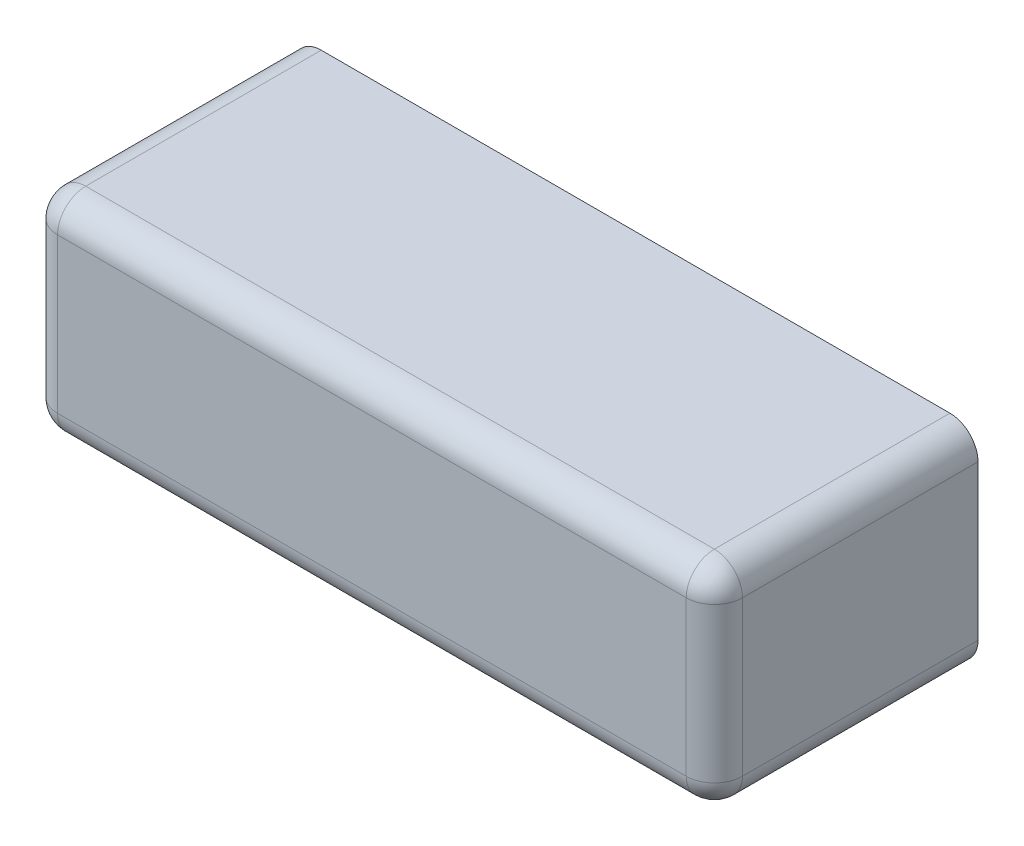
ISO-10303-21;
HEADER;
FILE_DESCRIPTION(('STEP AP214'),'2;1');
FILE_NAME('part.step','',(''),(''),'','','');
FILE_SCHEMA(('AUTOMOTIVE_DESIGN { 1 0 10303 214 1 1 1 1 }'));
ENDSEC;
DATA;
#1=APPLICATION_CONTEXT('core data for automotive mechanical design processes');
#2=APPLICATION_PROTOCOL_DEFINITION('international standard','automotive_design',2000,#1);
#3=PRODUCT_CONTEXT('',#1,'mechanical');
#4=PRODUCT('Part','Part','',(#3));
#5=PRODUCT_RELATED_PRODUCT_CATEGORY('part','',(#4));
#6=PRODUCT_DEFINITION_FORMATION('','',#4);
#7=PRODUCT_DEFINITION_CONTEXT('part definition',#1,'design');
#8=PRODUCT_DEFINITION('design','',#6,#7);
#9=PRODUCT_DEFINITION_SHAPE('','',#8);
#10=(LENGTH_UNIT() NAMED_UNIT(*) SI_UNIT(.MILLI.,.METRE.));
#11=(NAMED_UNIT(*) PLANE_ANGLE_UNIT() SI_UNIT($,.RADIAN.));
#12=(NAMED_UNIT(*) SI_UNIT($,.STERADIAN.) SOLID_ANGLE_UNIT());
#13=UNCERTAINTY_MEASURE_WITH_UNIT(LENGTH_MEASURE(1.E-05),#10,'distance_accuracy_value','');
#14=(GEOMETRIC_REPRESENTATION_CONTEXT(3) GLOBAL_UNCERTAINTY_ASSIGNED_CONTEXT((#13)) GLOBAL_UNIT_ASSIGNED_CONTEXT((#10,
#11,#12)) REPRESENTATION_CONTEXT('',''));
#15=CARTESIAN_POINT('',(0.,0.,0.));
#16=DIRECTION('',(0.,0.,1.));
#17=DIRECTION('',(1.,0.,0.));
#18=AXIS2_PLACEMENT_3D('',#15,#16,#17);
#19=CARTESIAN_POINT('',(-149.675063922113,-3.08847499691146,202.274504892547));
#20=DIRECTION('',(-1.,0.,0.));
#21=DIRECTION('',(0.,-1.,0.));
#22=AXIS2_PLACEMENT_3D('',#19,#20,#21);
#23=SPHERICAL_SURFACE('',#22,0.8);
#24=CARTESIAN_POINT('',(-149.675063922113,-3.08847499691146,202.274504892547));
#25=DIRECTION('',(0.,-1.,0.));
#26=DIRECTION('',(0.,0.,-1.));
#27=AXIS2_PLACEMENT_3D('',#24,#25,#26);
#28=CIRCLE('',#27,0.8);
#29=CARTESIAN_POINT('',(-150.475063922113,-3.08847499691146,202.274504892547));
#30=VERTEX_POINT('',#29);
#31=CARTESIAN_POINT('',(-149.675063922113,-3.08847499691146,203.074504892547));
#32=VERTEX_POINT('',#31);
#33=EDGE_CURVE('E221',#30,#32,#28,.F.);
#34=ORIENTED_EDGE('',*,*,#33,.F.);
#35=CARTESIAN_POINT('',(-149.675063922113,-3.08847499691146,202.274504892547));
#36=DIRECTION('',(0.,0.,-1.));
#37=DIRECTION('',(-1.,0.,0.));
#38=AXIS2_PLACEMENT_3D('',#35,#36,#37);
#39=CIRCLE('',#38,0.8);
#40=CARTESIAN_POINT('',(-149.675063922113,-3.88847499691146,202.274504892547));
#41=VERTEX_POINT('',#40);
#42=EDGE_CURVE('E71',#41,#30,#39,.T.);
#43=ORIENTED_EDGE('',*,*,#42,.F.);
#44=CARTESIAN_POINT('',(-149.675063922113,-3.08847499691146,202.274504892547));
#45=DIRECTION('',(1.,0.,0.));
#46=DIRECTION('',(0.,0.,-1.));
#47=AXIS2_PLACEMENT_3D('',#44,#45,#46);
#48=CIRCLE('',#47,0.8);
#49=EDGE_CURVE('E72',#32,#41,#48,.T.);
#50=ORIENTED_EDGE('',*,*,#49,.F.);
#51=EDGE_LOOP('',(#34,#43,#50));
#52=FACE_BOUND('',#51,.T.);
#53=ADVANCED_FACE('F17',(#52),#23,.T.);
#54=CARTESIAN_POINT('',(-131.775063922113,-3.08847499691146,202.274504892547));
#55=DIRECTION('',(-1.,0.,0.));
#56=DIRECTION('',(0.,-1.,0.));
#57=AXIS2_PLACEMENT_3D('',#54,#55,#56);
#58=SPHERICAL_SURFACE('',#57,0.8);
#59=CARTESIAN_POINT('',(-131.775063922113,-3.08847499691146,202.274504892547));
#60=DIRECTION('',(1.,0.,0.));
#61=DIRECTION('',(0.,0.,-1.));
#62=AXIS2_PLACEMENT_3D('',#59,#60,#61);
#63=CIRCLE('',#62,0.8);
#64=CARTESIAN_POINT('',(-131.775063922113,-3.88847499691146,202.274504892547));
#65=VERTEX_POINT('',#64);
#66=CARTESIAN_POINT('',(-131.775063922113,-3.08847499691146,203.074504892547));
#67=VERTEX_POINT('',#66);
#68=EDGE_CURVE('E216',#65,#67,#63,.F.);
#69=ORIENTED_EDGE('',*,*,#68,.F.);
#70=CARTESIAN_POINT('',(-131.775063922113,-3.08847499691146,202.274504892547));
#71=DIRECTION('',(0.,0.,-1.));
#72=DIRECTION('',(-1.,0.,0.));
#73=AXIS2_PLACEMENT_3D('',#70,#71,#72);
#74=CIRCLE('',#73,0.8);
#75=CARTESIAN_POINT('',(-130.975063922113,-3.08847499691146,202.274504892547));
#76=VERTEX_POINT('',#75);
#77=EDGE_CURVE('E191',#76,#65,#74,.T.);
#78=ORIENTED_EDGE('',*,*,#77,.F.);
#79=CARTESIAN_POINT('',(-131.775063922113,-3.08847499691146,202.274504892547));
#80=DIRECTION('',(0.,1.,0.));
#81=DIRECTION('',(0.,0.,1.));
#82=AXIS2_PLACEMENT_3D('',#79,#80,#81);
#83=CIRCLE('',#82,0.8);
#84=EDGE_CURVE('E198',#67,#76,#83,.T.);
#85=ORIENTED_EDGE('',*,*,#84,.F.);
#86=EDGE_LOOP('',(#69,#78,#85));
#87=FACE_BOUND('',#86,.T.);
#88=ADVANCED_FACE('F235',(#87),#58,.T.);
#89=CARTESIAN_POINT('',(-149.675063922113,-3.88847499691146,202.274504892547));
#90=DIRECTION('',(0.,-1.,0.));
#91=DIRECTION('',(0.,0.,-1.));
#92=AXIS2_PLACEMENT_3D('',#89,#90,#91);
#93=CYLINDRICAL_SURFACE('',#92,0.8);
#94=ORIENTED_EDGE('',*,*,#33,.T.);
#95=DIRECTION('',(0.,1.,0.));
#96=VECTOR('',#95,1.);
#97=CARTESIAN_POINT('',(-149.675063922113,-3.88847499691146,203.074504892547));
#98=LINE('',#97,#96);
#99=CARTESIAN_POINT('',(-149.675063922113,1.31152500308761,203.074504892547));
#100=VERTEX_POINT('',#99);
#101=EDGE_CURVE('E179',#100,#32,#98,.F.);
#102=ORIENTED_EDGE('',*,*,#101,.F.);
#103=CARTESIAN_POINT('',(-149.675063922113,1.31152500308854,202.274504892547));
#104=DIRECTION('',(0.,1.,3.06649722635464E-12));
#105=DIRECTION('',(-1.,0.,0.));
#106=AXIS2_PLACEMENT_3D('',#103,#104,#105);
#107=CIRCLE('',#106,0.8);
#108=CARTESIAN_POINT('',(-150.475063922113,1.31152500308853,202.274504892547));
#109=VERTEX_POINT('',#108);
#110=EDGE_CURVE('E168',#109,#100,#107,.T.);
#111=ORIENTED_EDGE('',*,*,#110,.F.);
#112=DIRECTION('',(0.,1.,0.));
#113=VECTOR('',#112,1.);
#114=CARTESIAN_POINT('',(-150.475063922113,-3.88847499691146,202.274504892547));
#115=LINE('',#114,#113);
#116=EDGE_CURVE('E171',#109,#30,#115,.F.);
#117=ORIENTED_EDGE('',*,*,#116,.T.);
#118=EDGE_LOOP('',(#94,#102,#111,#117));
#119=FACE_BOUND('',#118,.T.);
#120=ADVANCED_FACE('F238',(#119),#93,.T.);
#121=CARTESIAN_POINT('',(-130.975063922113,-3.08847499691146,202.274504892547));
#122=DIRECTION('',(1.,0.,0.));
#123=DIRECTION('',(0.,0.,-1.));
#124=AXIS2_PLACEMENT_3D('',#121,#122,#123);
#125=CYLINDRICAL_SURFACE('',#124,0.8);
#126=ORIENTED_EDGE('',*,*,#49,.T.);
#127=DIRECTION('',(1.,0.,0.));
#128=VECTOR('',#127,1.);
#129=CARTESIAN_POINT('',(-130.975063922113,-3.88847499691146,202.274504892547));
#130=LINE('',#129,#128);
#131=EDGE_CURVE('E80',#41,#65,#130,.T.);
#132=ORIENTED_EDGE('',*,*,#131,.T.);
#133=ORIENTED_EDGE('',*,*,#68,.T.);
#134=DIRECTION('',(1.,0.,0.));
#135=VECTOR('',#134,1.);
#136=CARTESIAN_POINT('',(-130.975063922113,-3.08847499691146,203.074504892547));
#137=LINE('',#136,#135);
#138=EDGE_CURVE('E172',#32,#67,#137,.T.);
#139=ORIENTED_EDGE('',*,*,#138,.F.);
#140=EDGE_LOOP('',(#126,#132,#133,#139));
#141=FACE_BOUND('',#140,.T.);
#142=ADVANCED_FACE('F242',(#141),#125,.T.);
#143=CARTESIAN_POINT('',(-149.675063922113,-3.08847499691146,203.074504892547));
#144=DIRECTION('',(0.,0.,-1.));
#145=DIRECTION('',(-1.,0.,0.));
#146=AXIS2_PLACEMENT_3D('',#143,#144,#145);
#147=CYLINDRICAL_SURFACE('',#146,0.8);
#148=DIRECTION('',(0.,0.,1.));
#149=VECTOR('',#148,1.);
#150=CARTESIAN_POINT('',(-149.675063922113,-3.88847499691146,203.074504892547));
#151=LINE('',#150,#149);
#152=CARTESIAN_POINT('',(-149.675063922113,-3.88847499691146,195.567624300072));
#153=VERTEX_POINT('',#152);
#154=EDGE_CURVE('E67',#153,#41,#151,.T.);
#155=ORIENTED_EDGE('',*,*,#154,.T.);
#156=ORIENTED_EDGE('',*,*,#42,.T.);
#157=DIRECTION('',(0.,0.,-1.));
#158=VECTOR('',#157,1.);
#159=CARTESIAN_POINT('',(-150.475063922113,-3.08847499691146,203.074504892547));
#160=LINE('',#159,#158);
#161=CARTESIAN_POINT('',(-150.475063922113,-3.08847499691146,195.567624300072));
#162=VERTEX_POINT('',#161);
#163=EDGE_CURVE('E69',#30,#162,#160,.T.);
#164=ORIENTED_EDGE('',*,*,#163,.T.);
#165=CARTESIAN_POINT('',(-149.675063922113,-3.08847499691146,195.567624300072));
#166=DIRECTION('',(0.,0.,-1.));
#167=DIRECTION('',(-1.,0.,0.));
#168=AXIS2_PLACEMENT_3D('',#165,#166,#167);
#169=CIRCLE('',#168,0.8);
#170=EDGE_CURVE('E21',#162,#153,#169,.F.);
#171=ORIENTED_EDGE('',*,*,#170,.T.);
#172=EDGE_LOOP('',(#155,#156,#164,#171));
#173=FACE_BOUND('',#172,.T.);
#174=ADVANCED_FACE('F64',(#173),#147,.T.);
#175=CARTESIAN_POINT('',(-131.775063922113,-3.88847499691146,202.274504892547));
#176=DIRECTION('',(0.,1.,0.));
#177=DIRECTION('',(0.,0.,1.));
#178=AXIS2_PLACEMENT_3D('',#175,#176,#177);
#179=CYLINDRICAL_SURFACE('',#178,0.8);
#180=ORIENTED_EDGE('',*,*,#84,.T.);
#181=DIRECTION('',(0.,1.,0.));
#182=VECTOR('',#181,1.);
#183=CARTESIAN_POINT('',(-130.975063922113,2.11152500308854,202.274504892547));
#184=LINE('',#183,#182);
#185=CARTESIAN_POINT('',(-130.975063922113,1.31152500308853,202.274504892547));
#186=VERTEX_POINT('',#185);
#187=EDGE_CURVE('E82',#76,#186,#184,.T.);
#188=ORIENTED_EDGE('',*,*,#187,.T.);
#189=CARTESIAN_POINT('',(-131.775063922113,1.31152500308853,202.274504892547));
#190=DIRECTION('',(0.,1.,0.));
#191=DIRECTION('',(0.,0.,1.));
#192=AXIS2_PLACEMENT_3D('',#189,#190,#191);
#193=CIRCLE('',#192,0.8);
#194=CARTESIAN_POINT('',(-131.775063922113,1.31152500308853,203.074504892547));
#195=VERTEX_POINT('',#194);
#196=EDGE_CURVE('E201',#186,#195,#193,.F.);
#197=ORIENTED_EDGE('',*,*,#196,.T.);
#198=DIRECTION('',(0.,1.,0.));
#199=VECTOR('',#198,1.);
#200=CARTESIAN_POINT('',(-131.775063922113,-3.88847499691146,203.074504892547));
#201=LINE('',#200,#199);
#202=EDGE_CURVE('E182',#67,#195,#201,.T.);
#203=ORIENTED_EDGE('',*,*,#202,.F.);
#204=EDGE_LOOP('',(#180,#188,#197,#203));
#205=FACE_BOUND('',#204,.T.);
#206=ADVANCED_FACE('F249',(#205),#179,.T.);
#207=CARTESIAN_POINT('',(-131.775063922113,-3.08847499691146,203.074504892547));
#208=DIRECTION('',(0.,0.,-1.));
#209=DIRECTION('',(-1.,0.,0.));
#210=AXIS2_PLACEMENT_3D('',#207,#208,#209);
#211=CYLINDRICAL_SURFACE('',#210,0.8);
#212=DIRECTION('',(0.,0.,1.));
#213=VECTOR('',#212,1.);
#214=CARTESIAN_POINT('',(-130.975063922113,-3.08847499691146,203.074504892547));
#215=LINE('',#214,#213);
#216=CARTESIAN_POINT('',(-130.975063922113,-3.08847499691146,195.567624300072));
#217=VERTEX_POINT('',#216);
#218=EDGE_CURVE('E128',#217,#76,#215,.T.);
#219=ORIENTED_EDGE('',*,*,#218,.T.);
#220=ORIENTED_EDGE('',*,*,#77,.T.);
#221=DIRECTION('',(0.,0.,1.));
#222=VECTOR('',#221,1.);
#223=CARTESIAN_POINT('',(-131.775063922113,-3.88847499691146,203.074504892547));
#224=LINE('',#223,#222);
#225=CARTESIAN_POINT('',(-131.775063922113,-3.88847499691146,195.567624300072));
#226=VERTEX_POINT('',#225);
#227=EDGE_CURVE('E83',#65,#226,#224,.F.);
#228=ORIENTED_EDGE('',*,*,#227,.T.);
#229=CARTESIAN_POINT('',(-131.775063922113,-3.08847499691146,195.567624300072));
#230=DIRECTION('',(0.,0.,-1.));
#231=DIRECTION('',(-1.,0.,0.));
#232=AXIS2_PLACEMENT_3D('',#229,#230,#231);
#233=CIRCLE('',#232,0.8);
#234=EDGE_CURVE('E87',#226,#217,#233,.F.);
#235=ORIENTED_EDGE('',*,*,#234,.T.);
#236=EDGE_LOOP('',(#219,#220,#228,#235));
#237=FACE_BOUND('',#236,.T.);
#238=ADVANCED_FACE('F251',(#237),#211,.T.);
#239=CARTESIAN_POINT('',(-130.975063922113,-3.88847499691146,203.074504892547));
#240=DIRECTION('',(0.,0.,1.));
#241=DIRECTION('',(1.,0.,0.));
#242=AXIS2_PLACEMENT_3D('',#239,#240,#241);
#243=PLANE('',#242);
#244=ORIENTED_EDGE('',*,*,#101,.T.);
#245=ORIENTED_EDGE('',*,*,#138,.T.);
#246=ORIENTED_EDGE('',*,*,#202,.T.);
#247=DIRECTION('',(-1.,0.,0.));
#248=VECTOR('',#247,1.);
#249=CARTESIAN_POINT('',(-130.975063922113,1.31152500308853,203.074504892547));
#250=LINE('',#249,#248);
#251=EDGE_CURVE('E122',#100,#195,#250,.F.);
#252=ORIENTED_EDGE('',*,*,#251,.F.);
#253=EDGE_LOOP('',(#244,#245,#246,#252));
#254=FACE_BOUND('',#253,.T.);
#255=ADVANCED_FACE('F160',(#254),#243,.T.);
#256=CARTESIAN_POINT('',(-149.675063922113,1.31152500308853,202.274504892547));
#257=DIRECTION('',(-1.,0.,0.));
#258=DIRECTION('',(0.,-1.,0.));
#259=AXIS2_PLACEMENT_3D('',#256,#257,#258);
#260=SPHERICAL_SURFACE('',#259,0.8);
#261=ORIENTED_EDGE('',*,*,#110,.T.);
#262=CARTESIAN_POINT('',(-149.675063922113,1.31152500308853,202.274504892547));
#263=DIRECTION('',(-1.,0.,0.));
#264=DIRECTION('',(0.,0.,1.));
#265=AXIS2_PLACEMENT_3D('',#262,#263,#264);
#266=CIRCLE('',#265,0.8);
#267=CARTESIAN_POINT('',(-149.675063922113,2.11152500308854,202.274504892547));
#268=VERTEX_POINT('',#267);
#269=EDGE_CURVE('E119',#268,#100,#266,.F.);
#270=ORIENTED_EDGE('',*,*,#269,.F.);
#271=CARTESIAN_POINT('',(-149.675063922113,1.31152500308853,202.274504892547));
#272=DIRECTION('',(0.,0.,-1.));
#273=DIRECTION('',(-1.,0.,0.));
#274=AXIS2_PLACEMENT_3D('',#271,#272,#273);
#275=CIRCLE('',#274,0.8);
#276=EDGE_CURVE('E108',#109,#268,#275,.T.);
#277=ORIENTED_EDGE('',*,*,#276,.F.);
#278=EDGE_LOOP('',(#261,#270,#277));
#279=FACE_BOUND('',#278,.T.);
#280=ADVANCED_FACE('F155',(#279),#260,.T.);
#281=CARTESIAN_POINT('',(-150.475063922113,-3.88847499691146,203.074504892547));
#282=DIRECTION('',(1.,0.,0.));
#283=DIRECTION('',(0.,0.,-1.));
#284=AXIS2_PLACEMENT_3D('',#281,#282,#283);
#285=PLANE('',#284);
#286=DIRECTION('',(0.,1.,0.));
#287=VECTOR('',#286,1.);
#288=CARTESIAN_POINT('',(-150.475063922113,-3.88847499691146,195.567624300072));
#289=LINE('',#288,#287);
#290=CARTESIAN_POINT('',(-150.475063922113,1.31152500308853,195.567624300072));
#291=VERTEX_POINT('',#290);
#292=EDGE_CURVE('E90',#291,#162,#289,.F.);
#293=ORIENTED_EDGE('',*,*,#292,.T.);
#294=ORIENTED_EDGE('',*,*,#163,.F.);
#295=ORIENTED_EDGE('',*,*,#116,.F.);
#296=DIRECTION('',(0.,0.,-1.));
#297=VECTOR('',#296,1.);
#298=CARTESIAN_POINT('',(-150.475063922113,1.31152500308853,203.074504892547));
#299=LINE('',#298,#297);
#300=EDGE_CURVE('E111',#291,#109,#299,.F.);
#301=ORIENTED_EDGE('',*,*,#300,.F.);
#302=EDGE_LOOP('',(#293,#294,#295,#301));
#303=FACE_BOUND('',#302,.T.);
#304=ADVANCED_FACE('F152',(#303),#285,.F.);
#305=CARTESIAN_POINT('',(-130.975063922113,-3.88847499691146,203.074504892547));
#306=DIRECTION('',(0.,1.,0.));
#307=DIRECTION('',(0.,0.,1.));
#308=AXIS2_PLACEMENT_3D('',#305,#306,#307);
#309=PLANE('',#308);
#310=DIRECTION('',(1.,0.,0.));
#311=VECTOR('',#310,1.);
#312=CARTESIAN_POINT('',(-130.975063922113,-3.88847499691146,195.567624300072));
#313=LINE('',#312,#311);
#314=EDGE_CURVE('E78',#153,#226,#313,.T.);
#315=ORIENTED_EDGE('',*,*,#314,.T.);
#316=ORIENTED_EDGE('',*,*,#227,.F.);
#317=ORIENTED_EDGE('',*,*,#131,.F.);
#318=ORIENTED_EDGE('',*,*,#154,.F.);
#319=EDGE_LOOP('',(#315,#316,#317,#318));
#320=FACE_BOUND('',#319,.T.);
#321=ADVANCED_FACE('F76',(#320),#309,.F.);
#322=CARTESIAN_POINT('',(-130.975063922113,2.11152500308854,203.074504892547));
#323=DIRECTION('',(-1.,0.,0.));
#324=DIRECTION('',(0.,0.,1.));
#325=AXIS2_PLACEMENT_3D('',#322,#323,#324);
#326=PLANE('',#325);
#327=DIRECTION('',(0.,1.,0.));
#328=VECTOR('',#327,1.);
#329=CARTESIAN_POINT('',(-130.975063922113,-3.88847499691146,195.567624300072));
#330=LINE('',#329,#328);
#331=CARTESIAN_POINT('',(-130.975063922113,1.31152500308853,195.567624300072));
#332=VERTEX_POINT('',#331);
#333=EDGE_CURVE('E89',#217,#332,#330,.T.);
#334=ORIENTED_EDGE('',*,*,#333,.T.);
#335=DIRECTION('',(0.,0.,-1.));
#336=VECTOR('',#335,1.);
#337=CARTESIAN_POINT('',(-130.975063922113,1.31152500308853,203.074504892547));
#338=LINE('',#337,#336);
#339=EDGE_CURVE('E93',#186,#332,#338,.T.);
#340=ORIENTED_EDGE('',*,*,#339,.F.);
#341=ORIENTED_EDGE('',*,*,#187,.F.);
#342=ORIENTED_EDGE('',*,*,#218,.F.);
#343=EDGE_LOOP('',(#334,#340,#341,#342));
#344=FACE_BOUND('',#343,.T.);
#345=ADVANCED_FACE('F144',(#344),#326,.F.);
#346=CARTESIAN_POINT('',(-131.775063922113,1.31152500308853,202.274504892547));
#347=DIRECTION('',(-1.,0.,0.));
#348=DIRECTION('',(0.,-1.,0.));
#349=AXIS2_PLACEMENT_3D('',#346,#347,#348);
#350=SPHERICAL_SURFACE('',#349,0.8);
#351=ORIENTED_EDGE('',*,*,#196,.F.);
#352=CARTESIAN_POINT('',(-131.775063922113,1.31152500308853,202.274504892547));
#353=DIRECTION('',(0.,0.,-1.));
#354=DIRECTION('',(-1.,0.,0.));
#355=AXIS2_PLACEMENT_3D('',#352,#353,#354);
#356=CIRCLE('',#355,0.8);
#357=CARTESIAN_POINT('',(-131.775063922113,2.11152500308854,202.274504892547));
#358=VERTEX_POINT('',#357);
#359=EDGE_CURVE('E116',#358,#186,#356,.T.);
#360=ORIENTED_EDGE('',*,*,#359,.F.);
#361=CARTESIAN_POINT('',(-131.775063922113,1.31152500308853,202.274504892547));
#362=DIRECTION('',(-1.,0.,0.));
#363=DIRECTION('',(0.,0.,1.));
#364=AXIS2_PLACEMENT_3D('',#361,#362,#363);
#365=CIRCLE('',#364,0.8);
#366=EDGE_CURVE('E123',#195,#358,#365,.T.);
#367=ORIENTED_EDGE('',*,*,#366,.F.);
#368=EDGE_LOOP('',(#351,#360,#367));
#369=FACE_BOUND('',#368,.T.);
#370=ADVANCED_FACE('F139',(#369),#350,.T.);
#371=CARTESIAN_POINT('',(-130.975063922113,1.31152500308853,202.274504892547));
#372=DIRECTION('',(-1.,0.,0.));
#373=DIRECTION('',(0.,0.,1.));
#374=AXIS2_PLACEMENT_3D('',#371,#372,#373);
#375=CYLINDRICAL_SURFACE('',#374,0.8);
#376=ORIENTED_EDGE('',*,*,#269,.T.);
#377=ORIENTED_EDGE('',*,*,#251,.T.);
#378=ORIENTED_EDGE('',*,*,#366,.T.);
#379=DIRECTION('',(1.,0.,0.));
#380=VECTOR('',#379,1.);
#381=CARTESIAN_POINT('',(-150.475063922113,2.11152500308854,202.274504892547));
#382=LINE('',#381,#380);
#383=EDGE_CURVE('E101',#358,#268,#382,.F.);
#384=ORIENTED_EDGE('',*,*,#383,.T.);
#385=EDGE_LOOP('',(#376,#377,#378,#384));
#386=FACE_BOUND('',#385,.T.);
#387=ADVANCED_FACE('F143',(#386),#375,.T.);
#388=CARTESIAN_POINT('',(-149.675063922113,1.31152500308853,203.074504892547));
#389=DIRECTION('',(0.,0.,-1.));
#390=DIRECTION('',(-1.,0.,0.));
#391=AXIS2_PLACEMENT_3D('',#388,#389,#390);
#392=CYLINDRICAL_SURFACE('',#391,0.8);
#393=ORIENTED_EDGE('',*,*,#300,.T.);
#394=ORIENTED_EDGE('',*,*,#276,.T.);
#395=DIRECTION('',(0.,0.,-1.));
#396=VECTOR('',#395,1.);
#397=CARTESIAN_POINT('',(-149.675063922113,2.11152500308854,203.074504892547));
#398=LINE('',#397,#396);
#399=CARTESIAN_POINT('',(-149.675063922113,2.11152500308854,195.567624300072));
#400=VERTEX_POINT('',#399);
#401=EDGE_CURVE('E98',#268,#400,#398,.T.);
#402=ORIENTED_EDGE('',*,*,#401,.T.);
#403=CARTESIAN_POINT('',(-149.675063922113,1.31152500308853,195.567624300072));
#404=DIRECTION('',(0.,0.,-1.));
#405=DIRECTION('',(-1.,0.,0.));
#406=AXIS2_PLACEMENT_3D('',#403,#404,#405);
#407=CIRCLE('',#406,0.8);
#408=EDGE_CURVE('E95',#400,#291,#407,.F.);
#409=ORIENTED_EDGE('',*,*,#408,.T.);
#410=EDGE_LOOP('',(#393,#394,#402,#409));
#411=FACE_BOUND('',#410,.T.);
#412=ADVANCED_FACE('F273',(#411),#392,.T.);
#413=CARTESIAN_POINT('',(-130.975063922113,-3.88847499691146,195.567624300072));
#414=DIRECTION('',(0.,0.,1.));
#415=DIRECTION('',(1.,0.,0.));
#416=AXIS2_PLACEMENT_3D('',#413,#414,#415);
#417=PLANE('',#416);
#418=CARTESIAN_POINT('',(-131.775063922113,1.31152500308853,195.567624300072));
#419=DIRECTION('',(0.,0.,-1.));
#420=DIRECTION('',(-1.,0.,0.));
#421=AXIS2_PLACEMENT_3D('',#418,#419,#420);
#422=CIRCLE('',#421,0.8);
#423=CARTESIAN_POINT('',(-131.775063922113,2.11152500308854,195.567624300072));
#424=VERTEX_POINT('',#423);
#425=EDGE_CURVE('E35',#332,#424,#422,.F.);
#426=ORIENTED_EDGE('',*,*,#425,.F.);
#427=ORIENTED_EDGE('',*,*,#333,.F.);
#428=ORIENTED_EDGE('',*,*,#234,.F.);
#429=ORIENTED_EDGE('',*,*,#314,.F.);
#430=ORIENTED_EDGE('',*,*,#170,.F.);
#431=ORIENTED_EDGE('',*,*,#292,.F.);
#432=ORIENTED_EDGE('',*,*,#408,.F.);
#433=DIRECTION('',(1.,0.,0.));
#434=VECTOR('',#433,1.);
#435=CARTESIAN_POINT('',(-150.475063922113,2.11152500308854,195.567624300072));
#436=LINE('',#435,#434);
#437=EDGE_CURVE('E27',#400,#424,#436,.T.);
#438=ORIENTED_EDGE('',*,*,#437,.T.);
#439=EDGE_LOOP('',(#426,#427,#428,#429,#430,#431,#432,#438));
#440=FACE_BOUND('',#439,.T.);
#441=ADVANCED_FACE('F85',(#440),#417,.F.);
#442=CARTESIAN_POINT('',(-131.775063922113,1.31152500308853,203.074504892547));
#443=DIRECTION('',(0.,0.,-1.));
#444=DIRECTION('',(-1.,0.,0.));
#445=AXIS2_PLACEMENT_3D('',#442,#443,#444);
#446=CYLINDRICAL_SURFACE('',#445,0.8);
#447=DIRECTION('',(0.,0.,-1.));
#448=VECTOR('',#447,1.);
#449=CARTESIAN_POINT('',(-131.775063922113,2.11152500308854,203.074504892547));
#450=LINE('',#449,#448);
#451=EDGE_CURVE('E11',#424,#358,#450,.F.);
#452=ORIENTED_EDGE('',*,*,#451,.T.);
#453=ORIENTED_EDGE('',*,*,#359,.T.);
#454=ORIENTED_EDGE('',*,*,#339,.T.);
#455=ORIENTED_EDGE('',*,*,#425,.T.);
#456=EDGE_LOOP('',(#452,#453,#454,#455));
#457=FACE_BOUND('',#456,.T.);
#458=ADVANCED_FACE('F263',(#457),#446,.T.);
#459=CARTESIAN_POINT('',(-150.475063922113,2.11152500308854,203.074504892547));
#460=DIRECTION('',(0.,-1.,0.));
#461=DIRECTION('',(0.,0.,-1.));
#462=AXIS2_PLACEMENT_3D('',#459,#460,#461);
#463=PLANE('',#462);
#464=ORIENTED_EDGE('',*,*,#437,.F.);
#465=ORIENTED_EDGE('',*,*,#401,.F.);
#466=ORIENTED_EDGE('',*,*,#383,.F.);
#467=ORIENTED_EDGE('',*,*,#451,.F.);
#468=EDGE_LOOP('',(#464,#465,#466,#467));
#469=FACE_BOUND('',#468,.T.);
#470=ADVANCED_FACE('F261',(#469),#463,.F.);
#471=CLOSED_SHELL('',(#53,#88,#120,#142,#174,#206,#238,#255,#280,#304,#321,#345,#370,#387,#412,
#441,#458,#470));
#472=MANIFOLD_SOLID_BREP('B1',#471);
#473=ADVANCED_BREP_SHAPE_REPRESENTATION('',(#18,#472),#14);
#474=SHAPE_DEFINITION_REPRESENTATION(#9,#473);
ENDSEC;
END-ISO-10303-21;
